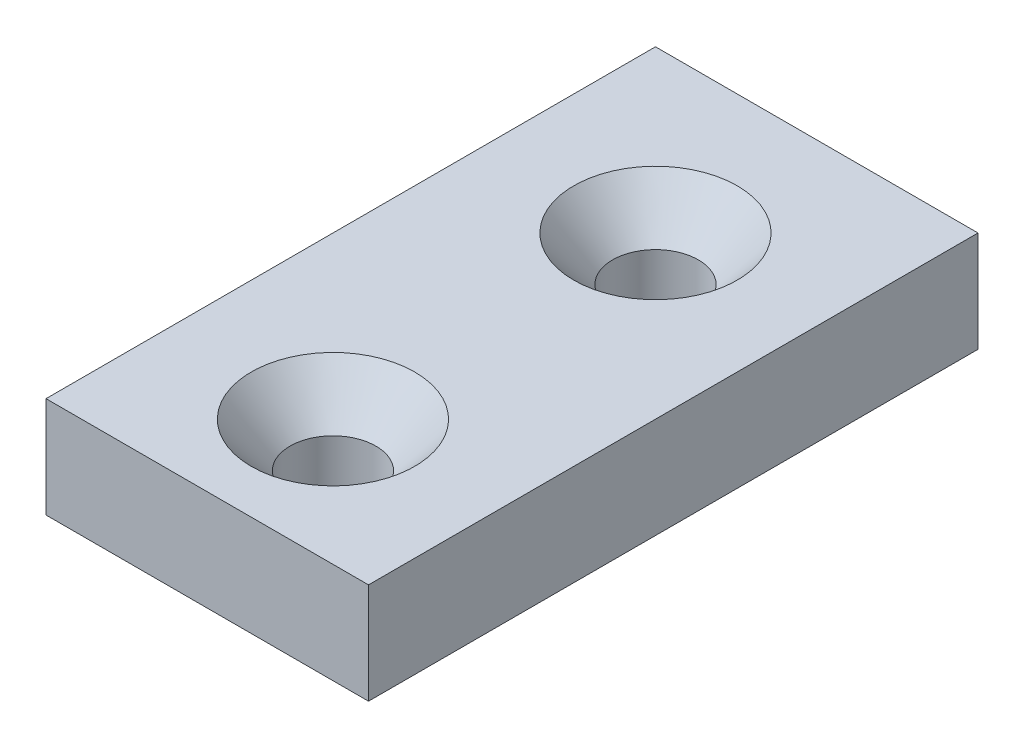
ISO-10303-21;
HEADER;
FILE_DESCRIPTION(('STEP AP214'),'2;1');
FILE_NAME('part.step','',(''),(''),'','','');
FILE_SCHEMA(('AUTOMOTIVE_DESIGN { 1 0 10303 214 1 1 1 1 }'));
ENDSEC;
DATA;
#1=APPLICATION_CONTEXT('core data for automotive mechanical design processes');
#2=APPLICATION_PROTOCOL_DEFINITION('international standard','automotive_design',2000,#1);
#3=PRODUCT_CONTEXT('',#1,'mechanical');
#4=PRODUCT('Part','Part','',(#3));
#5=PRODUCT_RELATED_PRODUCT_CATEGORY('part','',(#4));
#6=PRODUCT_DEFINITION_FORMATION('','',#4);
#7=PRODUCT_DEFINITION_CONTEXT('part definition',#1,'design');
#8=PRODUCT_DEFINITION('design','',#6,#7);
#9=PRODUCT_DEFINITION_SHAPE('','',#8);
#10=(LENGTH_UNIT() NAMED_UNIT(*) SI_UNIT(.MILLI.,.METRE.));
#11=(NAMED_UNIT(*) PLANE_ANGLE_UNIT() SI_UNIT($,.RADIAN.));
#12=(NAMED_UNIT(*) SI_UNIT($,.STERADIAN.) SOLID_ANGLE_UNIT());
#13=UNCERTAINTY_MEASURE_WITH_UNIT(LENGTH_MEASURE(1.E-05),#10,'distance_accuracy_value','');
#14=(GEOMETRIC_REPRESENTATION_CONTEXT(3) GLOBAL_UNCERTAINTY_ASSIGNED_CONTEXT((#13)) GLOBAL_UNIT_ASSIGNED_CONTEXT((#10,
#11,#12)) REPRESENTATION_CONTEXT('',''));
#15=CARTESIAN_POINT('',(0.,0.,0.));
#16=DIRECTION('',(0.,0.,1.));
#17=DIRECTION('',(1.,0.,0.));
#18=AXIS2_PLACEMENT_3D('',#15,#16,#17);
#19=CARTESIAN_POINT('',(-12.7,3.96875,24.));
#20=DIRECTION('',(1.,0.,0.));
#21=DIRECTION('',(0.,0.,-1.));
#22=AXIS2_PLACEMENT_3D('',#19,#20,#21);
#23=PLANE('',#22);
#24=DIRECTION('',(0.,-1.,0.));
#25=VECTOR('',#24,1.);
#26=CARTESIAN_POINT('',(-12.7,3.96875,-24.));
#27=LINE('',#26,#25);
#28=CARTESIAN_POINT('',(-12.7,3.96875,-24.));
#29=VERTEX_POINT('',#28);
#30=CARTESIAN_POINT('',(-12.7,-3.96875,-24.));
#31=VERTEX_POINT('',#30);
#32=EDGE_CURVE('E107',#29,#31,#27,.T.);
#33=ORIENTED_EDGE('',*,*,#32,.T.);
#34=DIRECTION('',(0.,0.,-1.));
#35=VECTOR('',#34,1.);
#36=CARTESIAN_POINT('',(-12.7,-3.96875,24.));
#37=LINE('',#36,#35);
#38=CARTESIAN_POINT('',(-12.7,-3.96875,24.));
#39=VERTEX_POINT('',#38);
#40=EDGE_CURVE('E11',#39,#31,#37,.T.);
#41=ORIENTED_EDGE('',*,*,#40,.F.);
#42=DIRECTION('',(0.,-1.,0.));
#43=VECTOR('',#42,1.);
#44=CARTESIAN_POINT('',(-12.7,3.96875,24.));
#45=LINE('',#44,#43);
#46=CARTESIAN_POINT('',(-12.7,3.96875,24.));
#47=VERTEX_POINT('',#46);
#48=EDGE_CURVE('E91',#47,#39,#45,.T.);
#49=ORIENTED_EDGE('',*,*,#48,.F.);
#50=DIRECTION('',(0.,0.,-1.));
#51=VECTOR('',#50,1.);
#52=CARTESIAN_POINT('',(-12.7,3.96875,24.));
#53=LINE('',#52,#51);
#54=EDGE_CURVE('E103',#47,#29,#53,.T.);
#55=ORIENTED_EDGE('',*,*,#54,.T.);
#56=EDGE_LOOP('',(#33,#41,#49,#55));
#57=FACE_BOUND('',#56,.T.);
#58=ADVANCED_FACE('F39',(#57),#23,.F.);
#59=CARTESIAN_POINT('',(12.7,-3.96875,24.));
#60=DIRECTION('',(0.,1.,0.));
#61=DIRECTION('',(0.,0.,1.));
#62=AXIS2_PLACEMENT_3D('',#59,#60,#61);
#63=PLANE('',#62);
#64=CARTESIAN_POINT('',(0.,-3.96875,14.1));
#65=DIRECTION('',(0.,1.,0.));
#66=DIRECTION('',(0.,0.,1.));
#67=AXIS2_PLACEMENT_3D('',#64,#65,#66);
#68=CIRCLE('',#67,3.37819999999999);
#69=CARTESIAN_POINT('',(0.,-3.96875,17.4782));
#70=VERTEX_POINT('',#69);
#71=EDGE_CURVE('E139',#70,#70,#68,.T.);
#72=ORIENTED_EDGE('',*,*,#71,.T.);
#73=EDGE_LOOP('',(#72));
#74=FACE_BOUND('',#73,.T.);
#75=CARTESIAN_POINT('',(0.,-3.96875,-11.3));
#76=DIRECTION('',(0.,1.,0.));
#77=DIRECTION('',(0.,0.,1.));
#78=AXIS2_PLACEMENT_3D('',#75,#76,#77);
#79=CIRCLE('',#78,3.37819999999999);
#80=CARTESIAN_POINT('',(0.,-3.96875,-7.92180000000001));
#81=VERTEX_POINT('',#80);
#82=EDGE_CURVE('E111',#81,#81,#79,.T.);
#83=ORIENTED_EDGE('',*,*,#82,.T.);
#84=EDGE_LOOP('',(#83));
#85=FACE_BOUND('',#84,.T.);
#86=DIRECTION('',(1.,0.,0.));
#87=VECTOR('',#86,1.);
#88=CARTESIAN_POINT('',(12.7,-3.96875,-24.));
#89=LINE('',#88,#87);
#90=CARTESIAN_POINT('',(12.7,-3.96875,-24.));
#91=VERTEX_POINT('',#90);
#92=EDGE_CURVE('E96',#31,#91,#89,.T.);
#93=ORIENTED_EDGE('',*,*,#92,.T.);
#94=DIRECTION('',(0.,0.,-1.));
#95=VECTOR('',#94,1.);
#96=CARTESIAN_POINT('',(12.7,-3.96875,24.));
#97=LINE('',#96,#95);
#98=CARTESIAN_POINT('',(12.7,-3.96875,24.));
#99=VERTEX_POINT('',#98);
#100=EDGE_CURVE('E48',#99,#91,#97,.T.);
#101=ORIENTED_EDGE('',*,*,#100,.F.);
#102=DIRECTION('',(1.,0.,0.));
#103=VECTOR('',#102,1.);
#104=CARTESIAN_POINT('',(12.7,-3.96875,24.));
#105=LINE('',#104,#103);
#106=EDGE_CURVE('E86',#39,#99,#105,.T.);
#107=ORIENTED_EDGE('',*,*,#106,.F.);
#108=ORIENTED_EDGE('',*,*,#40,.T.);
#109=EDGE_LOOP('',(#93,#101,#107,#108));
#110=FACE_BOUND('',#109,.T.);
#111=ADVANCED_FACE('F95',(#74,#85,#110),#63,.F.);
#112=CARTESIAN_POINT('',(12.7,3.96875,24.));
#113=DIRECTION('',(-1.,0.,0.));
#114=DIRECTION('',(0.,0.,1.));
#115=AXIS2_PLACEMENT_3D('',#112,#113,#114);
#116=PLANE('',#115);
#117=DIRECTION('',(0.,1.,0.));
#118=VECTOR('',#117,1.);
#119=CARTESIAN_POINT('',(12.7,3.96875,-24.));
#120=LINE('',#119,#118);
#121=CARTESIAN_POINT('',(12.7,3.96875,-24.));
#122=VERTEX_POINT('',#121);
#123=EDGE_CURVE('E73',#91,#122,#120,.T.);
#124=ORIENTED_EDGE('',*,*,#123,.T.);
#125=DIRECTION('',(0.,0.,-1.));
#126=VECTOR('',#125,1.);
#127=CARTESIAN_POINT('',(12.7,3.96875,24.));
#128=LINE('',#127,#126);
#129=CARTESIAN_POINT('',(12.7,3.96875,24.));
#130=VERTEX_POINT('',#129);
#131=EDGE_CURVE('E98',#130,#122,#128,.T.);
#132=ORIENTED_EDGE('',*,*,#131,.F.);
#133=DIRECTION('',(0.,1.,0.));
#134=VECTOR('',#133,1.);
#135=CARTESIAN_POINT('',(12.7,3.96875,24.));
#136=LINE('',#135,#134);
#137=EDGE_CURVE('E89',#99,#130,#136,.T.);
#138=ORIENTED_EDGE('',*,*,#137,.F.);
#139=ORIENTED_EDGE('',*,*,#100,.T.);
#140=EDGE_LOOP('',(#124,#132,#138,#139));
#141=FACE_BOUND('',#140,.T.);
#142=ADVANCED_FACE('F99',(#141),#116,.F.);
#143=CARTESIAN_POINT('',(12.7,3.96875,24.));
#144=DIRECTION('',(0.,-1.,0.));
#145=DIRECTION('',(0.,0.,-1.));
#146=AXIS2_PLACEMENT_3D('',#143,#144,#145);
#147=PLANE('',#146);
#148=CARTESIAN_POINT('',(0.,3.96875,14.1));
#149=DIRECTION('',(0.,1.,0.));
#150=DIRECTION('',(0.,0.,1.));
#151=AXIS2_PLACEMENT_3D('',#148,#149,#150);
#152=CIRCLE('',#151,6.4389);
#153=CARTESIAN_POINT('',(0.,3.96875,20.5389));
#154=VERTEX_POINT('',#153);
#155=EDGE_CURVE('E147',#154,#154,#152,.T.);
#156=ORIENTED_EDGE('',*,*,#155,.F.);
#157=EDGE_LOOP('',(#156));
#158=FACE_BOUND('',#157,.T.);
#159=CARTESIAN_POINT('',(0.,3.96875,-11.3));
#160=DIRECTION('',(0.,1.,0.));
#161=DIRECTION('',(0.,0.,1.));
#162=AXIS2_PLACEMENT_3D('',#159,#160,#161);
#163=CIRCLE('',#162,6.4389);
#164=CARTESIAN_POINT('',(0.,3.96875,-4.8611));
#165=VERTEX_POINT('',#164);
#166=EDGE_CURVE('E135',#165,#165,#163,.T.);
#167=ORIENTED_EDGE('',*,*,#166,.F.);
#168=EDGE_LOOP('',(#167));
#169=FACE_BOUND('',#168,.T.);
#170=DIRECTION('',(-1.,0.,0.));
#171=VECTOR('',#170,1.);
#172=CARTESIAN_POINT('',(12.7,3.96875,-24.));
#173=LINE('',#172,#171);
#174=EDGE_CURVE('E79',#122,#29,#173,.T.);
#175=ORIENTED_EDGE('',*,*,#174,.T.);
#176=ORIENTED_EDGE('',*,*,#54,.F.);
#177=DIRECTION('',(-1.,0.,0.));
#178=VECTOR('',#177,1.);
#179=CARTESIAN_POINT('',(12.7,3.96875,24.));
#180=LINE('',#179,#178);
#181=EDGE_CURVE('E56',#130,#47,#180,.T.);
#182=ORIENTED_EDGE('',*,*,#181,.F.);
#183=ORIENTED_EDGE('',*,*,#131,.T.);
#184=EDGE_LOOP('',(#175,#176,#182,#183));
#185=FACE_BOUND('',#184,.T.);
#186=ADVANCED_FACE('F121',(#158,#169,#185),#147,.F.);
#187=CARTESIAN_POINT('',(0.,0.,24.));
#188=DIRECTION('',(0.,0.,-1.));
#189=DIRECTION('',(-1.,0.,0.));
#190=AXIS2_PLACEMENT_3D('',#187,#188,#189);
#191=PLANE('',#190);
#192=ORIENTED_EDGE('',*,*,#48,.T.);
#193=ORIENTED_EDGE('',*,*,#106,.T.);
#194=ORIENTED_EDGE('',*,*,#137,.T.);
#195=ORIENTED_EDGE('',*,*,#181,.T.);
#196=EDGE_LOOP('',(#192,#193,#194,#195));
#197=FACE_BOUND('',#196,.T.);
#198=ADVANCED_FACE('F87',(#197),#191,.F.);
#199=CARTESIAN_POINT('',(0.,0.,-24.));
#200=DIRECTION('',(0.,0.,-1.));
#201=DIRECTION('',(-1.,0.,0.));
#202=AXIS2_PLACEMENT_3D('',#199,#200,#201);
#203=PLANE('',#202);
#204=ORIENTED_EDGE('',*,*,#32,.F.);
#205=ORIENTED_EDGE('',*,*,#174,.F.);
#206=ORIENTED_EDGE('',*,*,#123,.F.);
#207=ORIENTED_EDGE('',*,*,#92,.F.);
#208=EDGE_LOOP('',(#204,#205,#206,#207));
#209=FACE_BOUND('',#208,.T.);
#210=ADVANCED_FACE('F124',(#209),#203,.T.);
#211=CARTESIAN_POINT('',(0.,3.96875,-11.3));
#212=DIRECTION('',(0.,1.,0.));
#213=DIRECTION('',(0.,0.,1.));
#214=AXIS2_PLACEMENT_3D('',#211,#212,#213);
#215=CYLINDRICAL_SURFACE('',#214,3.37819999999999);
#216=ORIENTED_EDGE('',*,*,#82,.F.);
#217=EDGE_LOOP('',(#216));
#218=FACE_BOUND('',#217,.T.);
#219=CARTESIAN_POINT('',(0.,0.447817416018657,-11.3));
#220=DIRECTION('',(0.,1.,0.));
#221=DIRECTION('',(0.,0.,1.));
#222=AXIS2_PLACEMENT_3D('',#219,#220,#221);
#223=CIRCLE('',#222,3.3782);
#224=CARTESIAN_POINT('',(0.,0.447817416018657,-7.9218));
#225=VERTEX_POINT('',#224);
#226=EDGE_CURVE('E131',#225,#225,#223,.T.);
#227=ORIENTED_EDGE('',*,*,#226,.T.);
#228=EDGE_LOOP('',(#227));
#229=FACE_BOUND('',#228,.T.);
#230=ADVANCED_FACE('F162',(#218,#229),#215,.F.);
#231=CARTESIAN_POINT('',(0.,3.96875,-11.3));
#232=DIRECTION('',(0.,1.,0.));
#233=DIRECTION('',(0.,0.,1.));
#234=AXIS2_PLACEMENT_3D('',#231,#232,#233);
#235=CONICAL_SURFACE('',#234,6.4389,0.715584993317675);
#236=ORIENTED_EDGE('',*,*,#226,.F.);
#237=EDGE_LOOP('',(#236));
#238=FACE_BOUND('',#237,.T.);
#239=ORIENTED_EDGE('',*,*,#166,.T.);
#240=EDGE_LOOP('',(#239));
#241=FACE_BOUND('',#240,.T.);
#242=ADVANCED_FACE('F159',(#238,#241),#235,.F.);
#243=CARTESIAN_POINT('',(0.,3.96875,14.1));
#244=DIRECTION('',(0.,1.,0.));
#245=DIRECTION('',(0.,0.,1.));
#246=AXIS2_PLACEMENT_3D('',#243,#244,#245);
#247=CYLINDRICAL_SURFACE('',#246,3.37819999999999);
#248=ORIENTED_EDGE('',*,*,#71,.F.);
#249=EDGE_LOOP('',(#248));
#250=FACE_BOUND('',#249,.T.);
#251=CARTESIAN_POINT('',(0.,0.447817416018657,14.1));
#252=DIRECTION('',(0.,1.,0.));
#253=DIRECTION('',(0.,0.,1.));
#254=AXIS2_PLACEMENT_3D('',#251,#252,#253);
#255=CIRCLE('',#254,3.3782);
#256=CARTESIAN_POINT('',(0.,0.447817416018657,17.4782));
#257=VERTEX_POINT('',#256);
#258=EDGE_CURVE('E143',#257,#257,#255,.T.);
#259=ORIENTED_EDGE('',*,*,#258,.T.);
#260=EDGE_LOOP('',(#259));
#261=FACE_BOUND('',#260,.T.);
#262=ADVANCED_FACE('F161',(#250,#261),#247,.F.);
#263=CARTESIAN_POINT('',(0.,3.96875,14.1));
#264=DIRECTION('',(0.,1.,0.));
#265=DIRECTION('',(0.,0.,1.));
#266=AXIS2_PLACEMENT_3D('',#263,#264,#265);
#267=CONICAL_SURFACE('',#266,6.4389,0.715584993317675);
#268=ORIENTED_EDGE('',*,*,#258,.F.);
#269=EDGE_LOOP('',(#268));
#270=FACE_BOUND('',#269,.T.);
#271=ORIENTED_EDGE('',*,*,#155,.T.);
#272=EDGE_LOOP('',(#271));
#273=FACE_BOUND('',#272,.T.);
#274=ADVANCED_FACE('F152',(#270,#273),#267,.F.);
#275=CLOSED_SHELL('',(#58,#111,#142,#186,#198,#210,#230,#242,#262,#274));
#276=MANIFOLD_SOLID_BREP('B2',#275);
#277=ADVANCED_BREP_SHAPE_REPRESENTATION('',(#18,#276),#14);
#278=SHAPE_DEFINITION_REPRESENTATION(#9,#277);
ENDSEC;
END-ISO-10303-21;
